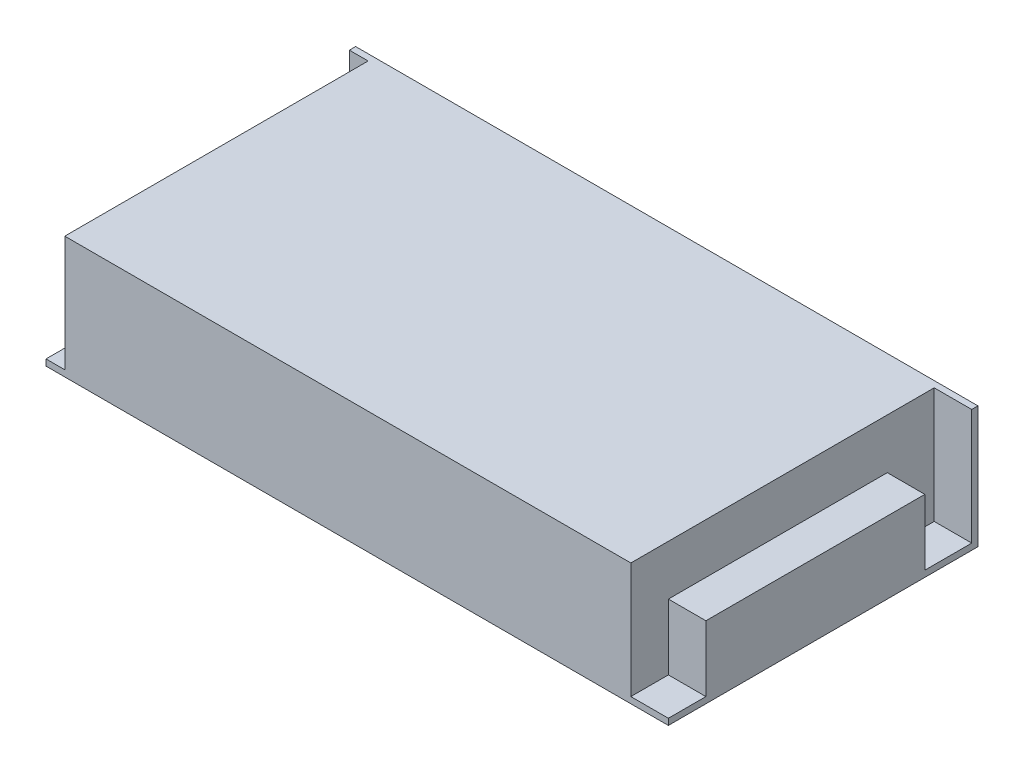
ISO-10303-21;
HEADER;
FILE_DESCRIPTION(('STEP AP214'),'2;1');
FILE_NAME('part.step','',(''),(''),'','','');
FILE_SCHEMA(('AUTOMOTIVE_DESIGN { 1 0 10303 214 1 1 1 1 }'));
ENDSEC;
DATA;
#1=APPLICATION_CONTEXT('core data for automotive mechanical design processes');
#2=APPLICATION_PROTOCOL_DEFINITION('international standard','automotive_design',2000,#1);
#3=PRODUCT_CONTEXT('',#1,'mechanical');
#4=PRODUCT('Part','Part','',(#3));
#5=PRODUCT_RELATED_PRODUCT_CATEGORY('part','',(#4));
#6=PRODUCT_DEFINITION_FORMATION('','',#4);
#7=PRODUCT_DEFINITION_CONTEXT('part definition',#1,'design');
#8=PRODUCT_DEFINITION('design','',#6,#7);
#9=PRODUCT_DEFINITION_SHAPE('','',#8);
#10=(LENGTH_UNIT() NAMED_UNIT(*) SI_UNIT(.MILLI.,.METRE.));
#11=(NAMED_UNIT(*) PLANE_ANGLE_UNIT() SI_UNIT($,.RADIAN.));
#12=(NAMED_UNIT(*) SI_UNIT($,.STERADIAN.) SOLID_ANGLE_UNIT());
#13=UNCERTAINTY_MEASURE_WITH_UNIT(LENGTH_MEASURE(1.E-05),#10,'distance_accuracy_value','');
#14=(GEOMETRIC_REPRESENTATION_CONTEXT(3) GLOBAL_UNCERTAINTY_ASSIGNED_CONTEXT((#13)) GLOBAL_UNIT_ASSIGNED_CONTEXT((#10,
#11,#12)) REPRESENTATION_CONTEXT('',''));
#15=CARTESIAN_POINT('',(0.,0.,0.));
#16=DIRECTION('',(0.,0.,1.));
#17=DIRECTION('',(1.,0.,0.));
#18=AXIS2_PLACEMENT_3D('',#15,#16,#17);
#19=CARTESIAN_POINT('',(0.,2.,0.));
#20=DIRECTION('',(0.,-1.,0.));
#21=DIRECTION('',(0.,0.,-1.));
#22=AXIS2_PLACEMENT_3D('',#19,#20,#21);
#23=PLANE('',#22);
#24=DIRECTION('',(-1.,0.,0.));
#25=VECTOR('',#24,1.);
#26=CARTESIAN_POINT('',(0.,2.,-82.));
#27=LINE('',#26,#25);
#28=CARTESIAN_POINT('',(199.,2.,-82.));
#29=VERTEX_POINT('',#28);
#30=CARTESIAN_POINT('',(187.,2.,-82.));
#31=VERTEX_POINT('',#30);
#32=EDGE_CURVE('E57',#29,#31,#27,.T.);
#33=ORIENTED_EDGE('',*,*,#32,.F.);
#34=DIRECTION('',(0.,0.,-1.));
#35=VECTOR('',#34,1.);
#36=CARTESIAN_POINT('',(199.,2.,0.));
#37=LINE('',#36,#35);
#38=CARTESIAN_POINT('',(199.,2.,-97.));
#39=VERTEX_POINT('',#38);
#40=EDGE_CURVE('E153',#29,#39,#37,.T.);
#41=ORIENTED_EDGE('',*,*,#40,.T.);
#42=DIRECTION('',(-1.,0.,0.));
#43=VECTOR('',#42,1.);
#44=CARTESIAN_POINT('',(199.,2.,-97.));
#45=LINE('',#44,#43);
#46=CARTESIAN_POINT('',(187.,2.,-97.));
#47=VERTEX_POINT('',#46);
#48=EDGE_CURVE('E215',#39,#47,#45,.T.);
#49=ORIENTED_EDGE('',*,*,#48,.T.);
#50=DIRECTION('',(0.,0.,1.));
#51=VECTOR('',#50,1.);
#52=CARTESIAN_POINT('',(187.,2.,0.));
#53=LINE('',#52,#51);
#54=EDGE_CURVE('E228',#47,#31,#53,.T.);
#55=ORIENTED_EDGE('',*,*,#54,.T.);
#56=EDGE_LOOP('',(#33,#41,#49,#55));
#57=FACE_BOUND('',#56,.T.);
#58=ADVANCED_FACE('F41',(#57),#23,.F.);
#59=DIRECTION('',(1.,0.,0.));
#60=VECTOR('',#59,1.);
#61=CARTESIAN_POINT('',(0.,2.,-12.));
#62=LINE('',#61,#60);
#63=CARTESIAN_POINT('',(187.,2.,-12.));
#64=VERTEX_POINT('',#63);
#65=CARTESIAN_POINT('',(199.,2.,-12.));
#66=VERTEX_POINT('',#65);
#67=EDGE_CURVE('E172',#64,#66,#62,.T.);
#68=ORIENTED_EDGE('',*,*,#67,.F.);
#69=CARTESIAN_POINT('',(187.,2.,0.));
#70=VERTEX_POINT('',#69);
#71=EDGE_CURVE('E231',#64,#70,#53,.T.);
#72=ORIENTED_EDGE('',*,*,#71,.T.);
#73=DIRECTION('',(1.,0.,0.));
#74=VECTOR('',#73,1.);
#75=CARTESIAN_POINT('',(199.,2.,0.));
#76=LINE('',#75,#74);
#77=CARTESIAN_POINT('',(199.,2.,0.));
#78=VERTEX_POINT('',#77);
#79=EDGE_CURVE('E224',#70,#78,#76,.T.);
#80=ORIENTED_EDGE('',*,*,#79,.T.);
#81=EDGE_CURVE('E65',#78,#66,#37,.T.);
#82=ORIENTED_EDGE('',*,*,#81,.T.);
#83=EDGE_LOOP('',(#68,#72,#80,#82));
#84=FACE_BOUND('',#83,.T.);
#85=ADVANCED_FACE('F302',(#84),#23,.F.);
#86=CARTESIAN_POINT('',(187.,-97.7394495585073,0.));
#87=DIRECTION('',(-1.,0.,0.));
#88=DIRECTION('',(0.,0.,1.));
#89=AXIS2_PLACEMENT_3D('',#86,#87,#88);
#90=PLANE('',#89);
#91=DIRECTION('',(0.,1.,0.));
#92=VECTOR('',#91,1.);
#93=CARTESIAN_POINT('',(187.,-97.7394495585073,-82.0000000000001));
#94=LINE('',#93,#92);
#95=CARTESIAN_POINT('',(187.,23.,-82.));
#96=VERTEX_POINT('',#95);
#97=EDGE_CURVE('E12',#31,#96,#94,.T.);
#98=ORIENTED_EDGE('',*,*,#97,.F.);
#99=ORIENTED_EDGE('',*,*,#54,.F.);
#100=DIRECTION('',(0.,1.,0.));
#101=VECTOR('',#100,1.);
#102=CARTESIAN_POINT('',(187.,-97.7394495585073,-97.));
#103=LINE('',#102,#101);
#104=CARTESIAN_POINT('',(187.,39.,-97.));
#105=VERTEX_POINT('',#104);
#106=EDGE_CURVE('E221',#47,#105,#103,.T.);
#107=ORIENTED_EDGE('',*,*,#106,.T.);
#108=DIRECTION('',(0.,0.,1.));
#109=VECTOR('',#108,1.);
#110=CARTESIAN_POINT('',(187.,39.,0.));
#111=LINE('',#110,#109);
#112=CARTESIAN_POINT('',(187.,39.,0.));
#113=VERTEX_POINT('',#112);
#114=EDGE_CURVE('E212',#105,#113,#111,.T.);
#115=ORIENTED_EDGE('',*,*,#114,.T.);
#116=DIRECTION('',(0.,1.,0.));
#117=VECTOR('',#116,1.);
#118=CARTESIAN_POINT('',(187.,-97.7394495585073,0.));
#119=LINE('',#118,#117);
#120=EDGE_CURVE('E227',#70,#113,#119,.T.);
#121=ORIENTED_EDGE('',*,*,#120,.F.);
#122=ORIENTED_EDGE('',*,*,#71,.F.);
#123=DIRECTION('',(0.,-1.,0.));
#124=VECTOR('',#123,1.);
#125=CARTESIAN_POINT('',(187.,0.,-12.));
#126=LINE('',#125,#124);
#127=CARTESIAN_POINT('',(187.,23.,-12.));
#128=VERTEX_POINT('',#127);
#129=EDGE_CURVE('E370',#128,#64,#126,.T.);
#130=ORIENTED_EDGE('',*,*,#129,.F.);
#131=DIRECTION('',(0.,0.,1.));
#132=VECTOR('',#131,1.);
#133=CARTESIAN_POINT('',(187.,23.,-12.));
#134=LINE('',#133,#132);
#135=EDGE_CURVE('E373',#96,#128,#134,.T.);
#136=ORIENTED_EDGE('',*,*,#135,.F.);
#137=EDGE_LOOP('',(#98,#99,#107,#115,#121,#122,#130,#136));
#138=FACE_BOUND('',#137,.T.);
#139=ADVANCED_FACE('F306',(#138),#90,.F.);
#140=CARTESIAN_POINT('',(0.,39.,0.));
#141=DIRECTION('',(1.,0.,0.));
#142=DIRECTION('',(0.,0.,-1.));
#143=AXIS2_PLACEMENT_3D('',#140,#141,#142);
#144=PLANE('',#143);
#145=DIRECTION('',(0.,-1.,0.));
#146=VECTOR('',#145,1.);
#147=CARTESIAN_POINT('',(0.,39.,0.));
#148=LINE('',#147,#146);
#149=CARTESIAN_POINT('',(0.,2.,0.));
#150=VERTEX_POINT('',#149);
#151=CARTESIAN_POINT('',(0.,0.,0.));
#152=VERTEX_POINT('',#151);
#153=EDGE_CURVE('E50',#150,#152,#148,.T.);
#154=ORIENTED_EDGE('',*,*,#153,.F.);
#155=DIRECTION('',(0.,0.,1.));
#156=VECTOR('',#155,1.);
#157=CARTESIAN_POINT('',(0.,2.,-97.));
#158=LINE('',#157,#156);
#159=CARTESIAN_POINT('',(0.,2.,-97.));
#160=VERTEX_POINT('',#159);
#161=EDGE_CURVE('E190',#160,#150,#158,.T.);
#162=ORIENTED_EDGE('',*,*,#161,.F.);
#163=DIRECTION('',(0.,1.,0.));
#164=VECTOR('',#163,1.);
#165=CARTESIAN_POINT('',(0.,-97.7394495585073,-97.));
#166=LINE('',#165,#164);
#167=CARTESIAN_POINT('',(0.,39.,-97.));
#168=VERTEX_POINT('',#167);
#169=EDGE_CURVE('E194',#160,#168,#166,.T.);
#170=ORIENTED_EDGE('',*,*,#169,.T.);
#171=DIRECTION('',(0.,0.,1.));
#172=VECTOR('',#171,1.);
#173=CARTESIAN_POINT('',(0.,39.,0.));
#174=LINE('',#173,#172);
#175=CARTESIAN_POINT('',(0.,39.,-99.));
#176=VERTEX_POINT('',#175);
#177=EDGE_CURVE('E240',#176,#168,#174,.T.);
#178=ORIENTED_EDGE('',*,*,#177,.F.);
#179=DIRECTION('',(0.,-1.,0.));
#180=VECTOR('',#179,1.);
#181=CARTESIAN_POINT('',(0.,39.,-99.));
#182=LINE('',#181,#180);
#183=CARTESIAN_POINT('',(0.,0.,-99.));
#184=VERTEX_POINT('',#183);
#185=EDGE_CURVE('E255',#176,#184,#182,.T.);
#186=ORIENTED_EDGE('',*,*,#185,.T.);
#187=DIRECTION('',(0.,0.,1.));
#188=VECTOR('',#187,1.);
#189=CARTESIAN_POINT('',(0.,0.,0.));
#190=LINE('',#189,#188);
#191=EDGE_CURVE('E193',#184,#152,#190,.T.);
#192=ORIENTED_EDGE('',*,*,#191,.T.);
#193=EDGE_LOOP('',(#154,#162,#170,#178,#186,#192));
#194=FACE_BOUND('',#193,.T.);
#195=ADVANCED_FACE('F43',(#194),#144,.F.);
#196=CARTESIAN_POINT('',(0.,39.,0.));
#197=DIRECTION('',(0.,0.,-1.));
#198=DIRECTION('',(-1.,0.,0.));
#199=AXIS2_PLACEMENT_3D('',#196,#197,#198);
#200=PLANE('',#199);
#201=DIRECTION('',(0.,1.,0.));
#202=VECTOR('',#201,1.);
#203=CARTESIAN_POINT('',(6.00000000000001,-97.7394495585073,0.));
#204=LINE('',#203,#202);
#205=CARTESIAN_POINT('',(6.00000000000001,2.,0.));
#206=VERTEX_POINT('',#205);
#207=CARTESIAN_POINT('',(6.00000000000001,39.,0.));
#208=VERTEX_POINT('',#207);
#209=EDGE_CURVE('E189',#206,#208,#204,.T.);
#210=ORIENTED_EDGE('',*,*,#209,.F.);
#211=DIRECTION('',(1.,0.,0.));
#212=VECTOR('',#211,1.);
#213=CARTESIAN_POINT('',(0.,2.,0.));
#214=LINE('',#213,#212);
#215=EDGE_CURVE('E181',#150,#206,#214,.T.);
#216=ORIENTED_EDGE('',*,*,#215,.F.);
#217=ORIENTED_EDGE('',*,*,#153,.T.);
#218=DIRECTION('',(1.,0.,0.));
#219=VECTOR('',#218,1.);
#220=CARTESIAN_POINT('',(0.,0.,0.));
#221=LINE('',#220,#219);
#222=CARTESIAN_POINT('',(199.,0.,0.));
#223=VERTEX_POINT('',#222);
#224=EDGE_CURVE('E259',#152,#223,#221,.T.);
#225=ORIENTED_EDGE('',*,*,#224,.T.);
#226=DIRECTION('',(0.,-1.,0.));
#227=VECTOR('',#226,1.);
#228=CARTESIAN_POINT('',(199.,39.,0.));
#229=LINE('',#228,#227);
#230=EDGE_CURVE('E275',#78,#223,#229,.T.);
#231=ORIENTED_EDGE('',*,*,#230,.F.);
#232=ORIENTED_EDGE('',*,*,#79,.F.);
#233=ORIENTED_EDGE('',*,*,#120,.T.);
#234=DIRECTION('',(1.,0.,0.));
#235=VECTOR('',#234,1.);
#236=CARTESIAN_POINT('',(0.,39.,0.));
#237=LINE('',#236,#235);
#238=EDGE_CURVE('E244',#208,#113,#237,.T.);
#239=ORIENTED_EDGE('',*,*,#238,.F.);
#240=EDGE_LOOP('',(#210,#216,#217,#225,#231,#232,#233,#239));
#241=FACE_BOUND('',#240,.T.);
#242=ADVANCED_FACE('F283',(#241),#200,.F.);
#243=CARTESIAN_POINT('',(199.,39.,0.));
#244=DIRECTION('',(-1.,0.,0.));
#245=DIRECTION('',(0.,0.,1.));
#246=AXIS2_PLACEMENT_3D('',#243,#244,#245);
#247=PLANE('',#246);
#248=DIRECTION('',(0.,0.,-1.));
#249=VECTOR('',#248,1.);
#250=CARTESIAN_POINT('',(199.,0.,0.));
#251=LINE('',#250,#249);
#252=CARTESIAN_POINT('',(199.,0.,-99.));
#253=VERTEX_POINT('',#252);
#254=EDGE_CURVE('E263',#223,#253,#251,.T.);
#255=ORIENTED_EDGE('',*,*,#254,.T.);
#256=DIRECTION('',(0.,-1.,0.));
#257=VECTOR('',#256,1.);
#258=CARTESIAN_POINT('',(199.,39.,-99.));
#259=LINE('',#258,#257);
#260=CARTESIAN_POINT('',(199.,39.,-99.));
#261=VERTEX_POINT('',#260);
#262=EDGE_CURVE('E271',#261,#253,#259,.T.);
#263=ORIENTED_EDGE('',*,*,#262,.F.);
#264=DIRECTION('',(0.,0.,-1.));
#265=VECTOR('',#264,1.);
#266=CARTESIAN_POINT('',(199.,39.,0.));
#267=LINE('',#266,#265);
#268=CARTESIAN_POINT('',(199.,39.,-97.));
#269=VERTEX_POINT('',#268);
#270=EDGE_CURVE('E249',#269,#261,#267,.T.);
#271=ORIENTED_EDGE('',*,*,#270,.F.);
#272=DIRECTION('',(0.,1.,0.));
#273=VECTOR('',#272,1.);
#274=CARTESIAN_POINT('',(199.,-97.7394495585073,-97.));
#275=LINE('',#274,#273);
#276=EDGE_CURVE('E185',#39,#269,#275,.T.);
#277=ORIENTED_EDGE('',*,*,#276,.F.);
#278=ORIENTED_EDGE('',*,*,#40,.F.);
#279=DIRECTION('',(0.,-1.,0.));
#280=VECTOR('',#279,1.);
#281=CARTESIAN_POINT('',(199.,0.,-82.));
#282=LINE('',#281,#280);
#283=CARTESIAN_POINT('',(199.,23.,-82.));
#284=VERTEX_POINT('',#283);
#285=EDGE_CURVE('E145',#284,#29,#282,.T.);
#286=ORIENTED_EDGE('',*,*,#285,.F.);
#287=DIRECTION('',(0.,0.,-1.));
#288=VECTOR('',#287,1.);
#289=CARTESIAN_POINT('',(199.,23.,-12.));
#290=LINE('',#289,#288);
#291=CARTESIAN_POINT('',(199.,23.,-12.));
#292=VERTEX_POINT('',#291);
#293=EDGE_CURVE('E150',#292,#284,#290,.T.);
#294=ORIENTED_EDGE('',*,*,#293,.F.);
#295=DIRECTION('',(0.,1.,0.));
#296=VECTOR('',#295,1.);
#297=CARTESIAN_POINT('',(199.,0.,-12.));
#298=LINE('',#297,#296);
#299=EDGE_CURVE('E156',#66,#292,#298,.T.);
#300=ORIENTED_EDGE('',*,*,#299,.F.);
#301=ORIENTED_EDGE('',*,*,#81,.F.);
#302=ORIENTED_EDGE('',*,*,#230,.T.);
#303=EDGE_LOOP('',(#255,#263,#271,#277,#278,#286,#294,#300,#301,#302));
#304=FACE_BOUND('',#303,.T.);
#305=ADVANCED_FACE('F147',(#304),#247,.F.);
#306=CARTESIAN_POINT('',(0.,39.,-99.));
#307=DIRECTION('',(0.,0.,1.));
#308=DIRECTION('',(1.,0.,0.));
#309=AXIS2_PLACEMENT_3D('',#306,#307,#308);
#310=PLANE('',#309);
#311=DIRECTION('',(-1.,0.,0.));
#312=VECTOR('',#311,1.);
#313=CARTESIAN_POINT('',(0.,0.,-99.));
#314=LINE('',#313,#312);
#315=EDGE_CURVE('E245',#253,#184,#314,.T.);
#316=ORIENTED_EDGE('',*,*,#315,.T.);
#317=ORIENTED_EDGE('',*,*,#185,.F.);
#318=DIRECTION('',(-1.,0.,0.));
#319=VECTOR('',#318,1.);
#320=CARTESIAN_POINT('',(0.,39.,-99.));
#321=LINE('',#320,#319);
#322=EDGE_CURVE('E252',#261,#176,#321,.T.);
#323=ORIENTED_EDGE('',*,*,#322,.F.);
#324=ORIENTED_EDGE('',*,*,#262,.T.);
#325=EDGE_LOOP('',(#316,#317,#323,#324));
#326=FACE_BOUND('',#325,.T.);
#327=ADVANCED_FACE('F296',(#326),#310,.F.);
#328=CARTESIAN_POINT('',(0.,39.,0.));
#329=DIRECTION('',(0.,-1.,0.));
#330=DIRECTION('',(0.,0.,-1.));
#331=AXIS2_PLACEMENT_3D('',#328,#329,#330);
#332=PLANE('',#331);
#333=DIRECTION('',(-1.,0.,0.));
#334=VECTOR('',#333,1.);
#335=CARTESIAN_POINT('',(0.,39.,-97.));
#336=LINE('',#335,#334);
#337=CARTESIAN_POINT('',(6.,39.,-97.));
#338=VERTEX_POINT('',#337);
#339=EDGE_CURVE('E178',#338,#168,#336,.T.);
#340=ORIENTED_EDGE('',*,*,#339,.F.);
#341=DIRECTION('',(0.,0.,-1.));
#342=VECTOR('',#341,1.);
#343=CARTESIAN_POINT('',(6.,39.,-97.));
#344=LINE('',#343,#342);
#345=EDGE_CURVE('E182',#208,#338,#344,.T.);
#346=ORIENTED_EDGE('',*,*,#345,.F.);
#347=ORIENTED_EDGE('',*,*,#238,.T.);
#348=ORIENTED_EDGE('',*,*,#114,.F.);
#349=DIRECTION('',(-1.,0.,0.));
#350=VECTOR('',#349,1.);
#351=CARTESIAN_POINT('',(199.,39.,-97.));
#352=LINE('',#351,#350);
#353=EDGE_CURVE('E177',#269,#105,#352,.T.);
#354=ORIENTED_EDGE('',*,*,#353,.F.);
#355=ORIENTED_EDGE('',*,*,#270,.T.);
#356=ORIENTED_EDGE('',*,*,#322,.T.);
#357=ORIENTED_EDGE('',*,*,#177,.T.);
#358=EDGE_LOOP('',(#340,#346,#347,#348,#354,#355,#356,#357));
#359=FACE_BOUND('',#358,.T.);
#360=ADVANCED_FACE('F312',(#359),#332,.F.);
#361=CARTESIAN_POINT('',(0.,0.,0.));
#362=DIRECTION('',(0.,-1.,0.));
#363=DIRECTION('',(0.,0.,-1.));
#364=AXIS2_PLACEMENT_3D('',#361,#362,#363);
#365=PLANE('',#364);
#366=ORIENTED_EDGE('',*,*,#315,.F.);
#367=ORIENTED_EDGE('',*,*,#254,.F.);
#368=ORIENTED_EDGE('',*,*,#224,.F.);
#369=ORIENTED_EDGE('',*,*,#191,.F.);
#370=EDGE_LOOP('',(#366,#367,#368,#369));
#371=FACE_BOUND('',#370,.T.);
#372=ADVANCED_FACE('F291',(#371),#365,.T.);
#373=CARTESIAN_POINT('',(199.,-97.7394495585073,-97.));
#374=DIRECTION('',(0.,0.,-1.));
#375=DIRECTION('',(-1.,0.,0.));
#376=AXIS2_PLACEMENT_3D('',#373,#374,#375);
#377=PLANE('',#376);
#378=ORIENTED_EDGE('',*,*,#276,.T.);
#379=ORIENTED_EDGE('',*,*,#353,.T.);
#380=ORIENTED_EDGE('',*,*,#106,.F.);
#381=ORIENTED_EDGE('',*,*,#48,.F.);
#382=EDGE_LOOP('',(#378,#379,#380,#381));
#383=FACE_BOUND('',#382,.T.);
#384=ADVANCED_FACE('F338',(#383),#377,.F.);
#385=CARTESIAN_POINT('',(0.,2.,0.));
#386=DIRECTION('',(0.,-1.,0.));
#387=DIRECTION('',(0.,0.,-1.));
#388=AXIS2_PLACEMENT_3D('',#385,#386,#387);
#389=PLANE('',#388);
#390=ORIENTED_EDGE('',*,*,#161,.T.);
#391=ORIENTED_EDGE('',*,*,#215,.T.);
#392=DIRECTION('',(0.,0.,-1.));
#393=VECTOR('',#392,1.);
#394=CARTESIAN_POINT('',(6.,2.,-97.));
#395=LINE('',#394,#393);
#396=CARTESIAN_POINT('',(6.,2.,-97.));
#397=VERTEX_POINT('',#396);
#398=EDGE_CURVE('E200',#206,#397,#395,.T.);
#399=ORIENTED_EDGE('',*,*,#398,.T.);
#400=DIRECTION('',(-1.,0.,0.));
#401=VECTOR('',#400,1.);
#402=CARTESIAN_POINT('',(0.,2.,-97.));
#403=LINE('',#402,#401);
#404=EDGE_CURVE('E195',#397,#160,#403,.T.);
#405=ORIENTED_EDGE('',*,*,#404,.T.);
#406=EDGE_LOOP('',(#390,#391,#399,#405));
#407=FACE_BOUND('',#406,.T.);
#408=ADVANCED_FACE('F318',(#407),#389,.F.);
#409=CARTESIAN_POINT('',(6.,-97.7394495585073,-97.));
#410=DIRECTION('',(1.,0.,0.));
#411=DIRECTION('',(0.,0.,-1.));
#412=AXIS2_PLACEMENT_3D('',#409,#410,#411);
#413=PLANE('',#412);
#414=ORIENTED_EDGE('',*,*,#209,.T.);
#415=ORIENTED_EDGE('',*,*,#345,.T.);
#416=DIRECTION('',(0.,1.,0.));
#417=VECTOR('',#416,1.);
#418=CARTESIAN_POINT('',(6.,-97.7394495585073,-97.));
#419=LINE('',#418,#417);
#420=EDGE_CURVE('E199',#397,#338,#419,.T.);
#421=ORIENTED_EDGE('',*,*,#420,.F.);
#422=ORIENTED_EDGE('',*,*,#398,.F.);
#423=EDGE_LOOP('',(#414,#415,#421,#422));
#424=FACE_BOUND('',#423,.T.);
#425=ADVANCED_FACE('F315',(#424),#413,.F.);
#426=CARTESIAN_POINT('',(0.,-97.7394495585073,-97.));
#427=DIRECTION('',(0.,0.,-1.));
#428=DIRECTION('',(-1.,0.,0.));
#429=AXIS2_PLACEMENT_3D('',#426,#427,#428);
#430=PLANE('',#429);
#431=ORIENTED_EDGE('',*,*,#420,.T.);
#432=ORIENTED_EDGE('',*,*,#339,.T.);
#433=ORIENTED_EDGE('',*,*,#169,.F.);
#434=ORIENTED_EDGE('',*,*,#404,.F.);
#435=EDGE_LOOP('',(#431,#432,#433,#434));
#436=FACE_BOUND('',#435,.T.);
#437=ADVANCED_FACE('F320',(#436),#430,.F.);
#438=CARTESIAN_POINT('',(272.681748079155,0.,-82.));
#439=DIRECTION('',(0.,0.,1.));
#440=DIRECTION('',(0.,-1.,0.));
#441=AXIS2_PLACEMENT_3D('',#438,#439,#440);
#442=PLANE('',#441);
#443=ORIENTED_EDGE('',*,*,#285,.T.);
#444=ORIENTED_EDGE('',*,*,#32,.T.);
#445=ORIENTED_EDGE('',*,*,#97,.T.);
#446=DIRECTION('',(-1.,0.,0.));
#447=VECTOR('',#446,1.);
#448=CARTESIAN_POINT('',(272.681748079155,23.,-82.));
#449=LINE('',#448,#447);
#450=EDGE_CURVE('E159',#284,#96,#449,.T.);
#451=ORIENTED_EDGE('',*,*,#450,.F.);
#452=EDGE_LOOP('',(#443,#444,#445,#451));
#453=FACE_BOUND('',#452,.T.);
#454=ADVANCED_FACE('F160',(#453),#442,.F.);
#455=CARTESIAN_POINT('',(272.681748079155,0.,-12.));
#456=DIRECTION('',(0.,0.,-1.));
#457=DIRECTION('',(-1.,0.,0.));
#458=AXIS2_PLACEMENT_3D('',#455,#456,#457);
#459=PLANE('',#458);
#460=ORIENTED_EDGE('',*,*,#129,.T.);
#461=ORIENTED_EDGE('',*,*,#67,.T.);
#462=ORIENTED_EDGE('',*,*,#299,.T.);
#463=DIRECTION('',(-1.,0.,0.));
#464=VECTOR('',#463,1.);
#465=CARTESIAN_POINT('',(272.681748079155,23.,-12.));
#466=LINE('',#465,#464);
#467=EDGE_CURVE('E164',#292,#128,#466,.T.);
#468=ORIENTED_EDGE('',*,*,#467,.T.);
#469=EDGE_LOOP('',(#460,#461,#462,#468));
#470=FACE_BOUND('',#469,.T.);
#471=ADVANCED_FACE('F327',(#470),#459,.F.);
#472=CARTESIAN_POINT('',(272.681748079155,23.,-12.));
#473=DIRECTION('',(0.,-1.,0.));
#474=DIRECTION('',(0.,0.,-1.));
#475=AXIS2_PLACEMENT_3D('',#472,#473,#474);
#476=PLANE('',#475);
#477=ORIENTED_EDGE('',*,*,#467,.F.);
#478=ORIENTED_EDGE('',*,*,#293,.T.);
#479=ORIENTED_EDGE('',*,*,#450,.T.);
#480=ORIENTED_EDGE('',*,*,#135,.T.);
#481=EDGE_LOOP('',(#477,#478,#479,#480));
#482=FACE_BOUND('',#481,.T.);
#483=ADVANCED_FACE('F166',(#482),#476,.F.);
#484=CLOSED_SHELL('',(#58,#85,#139,#195,#242,#305,#327,#360,#372,#384,#408,#425,#437,#454,#471,#483));
#485=MANIFOLD_SOLID_BREP('B2',#484);
#486=ADVANCED_BREP_SHAPE_REPRESENTATION('',(#18,#485),#14);
#487=SHAPE_DEFINITION_REPRESENTATION(#9,#486);
ENDSEC;
END-ISO-10303-21;
